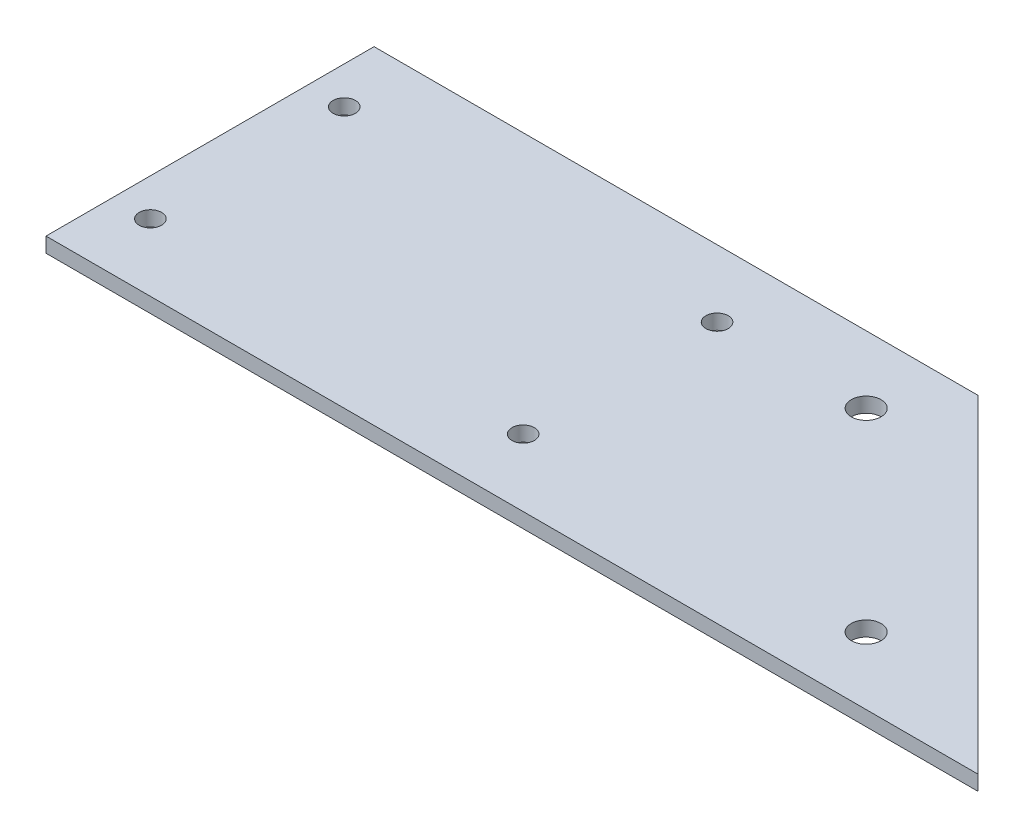
ISO-10303-21;
HEADER;
FILE_DESCRIPTION(('STEP AP214'),'2;1');
FILE_NAME('part.step','',(''),(''),'','','');
FILE_SCHEMA(('AUTOMOTIVE_DESIGN { 1 0 10303 214 1 1 1 1 }'));
ENDSEC;
DATA;
#1=APPLICATION_CONTEXT('core data for automotive mechanical design processes');
#2=APPLICATION_PROTOCOL_DEFINITION('international standard','automotive_design',2000,#1);
#3=PRODUCT_CONTEXT('',#1,'mechanical');
#4=PRODUCT('Part','Part','',(#3));
#5=PRODUCT_RELATED_PRODUCT_CATEGORY('part','',(#4));
#6=PRODUCT_DEFINITION_FORMATION('','',#4);
#7=PRODUCT_DEFINITION_CONTEXT('part definition',#1,'design');
#8=PRODUCT_DEFINITION('design','',#6,#7);
#9=PRODUCT_DEFINITION_SHAPE('','',#8);
#10=(LENGTH_UNIT() NAMED_UNIT(*) SI_UNIT(.MILLI.,.METRE.));
#11=(NAMED_UNIT(*) PLANE_ANGLE_UNIT() SI_UNIT($,.RADIAN.));
#12=(NAMED_UNIT(*) SI_UNIT($,.STERADIAN.) SOLID_ANGLE_UNIT());
#13=UNCERTAINTY_MEASURE_WITH_UNIT(LENGTH_MEASURE(1.E-05),#10,'distance_accuracy_value','');
#14=(GEOMETRIC_REPRESENTATION_CONTEXT(3) GLOBAL_UNCERTAINTY_ASSIGNED_CONTEXT((#13)) GLOBAL_UNIT_ASSIGNED_CONTEXT((#10,
#11,#12)) REPRESENTATION_CONTEXT('',''));
#15=CARTESIAN_POINT('',(0.,0.,0.));
#16=DIRECTION('',(0.,0.,1.));
#17=DIRECTION('',(1.,0.,0.));
#18=AXIS2_PLACEMENT_3D('',#15,#16,#17);
#19=CARTESIAN_POINT('',(0.,2.,-44.));
#20=DIRECTION('',(0.,-1.,0.));
#21=DIRECTION('',(0.,0.,-1.));
#22=AXIS2_PLACEMENT_3D('',#19,#20,#21);
#23=PLANE('',#22);
#24=CARTESIAN_POINT('',(75.,2.,-35.));
#25=DIRECTION('',(0.,1.,0.));
#26=DIRECTION('',(0.,0.,1.));
#27=AXIS2_PLACEMENT_3D('',#24,#25,#26);
#28=CIRCLE('',#27,1.99999999999998);
#29=CARTESIAN_POINT('',(75.,2.,-33.));
#30=VERTEX_POINT('',#29);
#31=EDGE_CURVE('E130',#30,#30,#28,.T.);
#32=ORIENTED_EDGE('',*,*,#31,.F.);
#33=EDGE_LOOP('',(#32));
#34=FACE_BOUND('',#33,.T.);
#35=CARTESIAN_POINT('',(55.,2.,-9.));
#36=DIRECTION('',(0.,1.,0.));
#37=DIRECTION('',(0.,0.,1.));
#38=AXIS2_PLACEMENT_3D('',#35,#36,#37);
#39=CIRCLE('',#38,1.5);
#40=CARTESIAN_POINT('',(55.,2.,-7.49999999999999));
#41=VERTEX_POINT('',#40);
#42=EDGE_CURVE('E118',#41,#41,#39,.T.);
#43=ORIENTED_EDGE('',*,*,#42,.F.);
#44=EDGE_LOOP('',(#43));
#45=FACE_BOUND('',#44,.T.);
#46=CARTESIAN_POINT('',(5.,2.,-35.));
#47=DIRECTION('',(0.,1.,0.));
#48=DIRECTION('',(0.,0.,1.));
#49=AXIS2_PLACEMENT_3D('',#46,#47,#48);
#50=CIRCLE('',#49,1.5);
#51=CARTESIAN_POINT('',(5.,2.,-33.5));
#52=VERTEX_POINT('',#51);
#53=EDGE_CURVE('E97',#52,#52,#50,.T.);
#54=ORIENTED_EDGE('',*,*,#53,.F.);
#55=EDGE_LOOP('',(#54));
#56=FACE_BOUND('',#55,.T.);
#57=DIRECTION('',(0.,0.,1.));
#58=VECTOR('',#57,1.);
#59=CARTESIAN_POINT('',(0.,2.,0.));
#60=LINE('',#59,#58);
#61=CARTESIAN_POINT('',(0.,2.,-44.));
#62=VERTEX_POINT('',#61);
#63=CARTESIAN_POINT('',(0.,2.,0.));
#64=VERTEX_POINT('',#63);
#65=EDGE_CURVE('E82',#62,#64,#60,.T.);
#66=ORIENTED_EDGE('',*,*,#65,.T.);
#67=DIRECTION('',(1.,0.,0.));
#68=VECTOR('',#67,1.);
#69=CARTESIAN_POINT('',(0.,2.,0.));
#70=LINE('',#69,#68);
#71=CARTESIAN_POINT('',(125.,2.,0.));
#72=VERTEX_POINT('',#71);
#73=EDGE_CURVE('E77',#64,#72,#70,.T.);
#74=ORIENTED_EDGE('',*,*,#73,.T.);
#75=DIRECTION('',(-0.707106781186546,0.,-0.707106781186549));
#76=VECTOR('',#75,1.);
#77=CARTESIAN_POINT('',(81.0000000000002,2.,-44.));
#78=LINE('',#77,#76);
#79=CARTESIAN_POINT('',(81.0000000000002,2.,-44.));
#80=VERTEX_POINT('',#79);
#81=EDGE_CURVE('E80',#72,#80,#78,.T.);
#82=ORIENTED_EDGE('',*,*,#81,.T.);
#83=DIRECTION('',(-1.,0.,0.));
#84=VECTOR('',#83,1.);
#85=CARTESIAN_POINT('',(0.,2.,-44.));
#86=LINE('',#85,#84);
#87=EDGE_CURVE('E47',#80,#62,#86,.T.);
#88=ORIENTED_EDGE('',*,*,#87,.T.);
#89=EDGE_LOOP('',(#66,#74,#82,#88));
#90=FACE_BOUND('',#89,.T.);
#91=CARTESIAN_POINT('',(5.,2.,-9.));
#92=DIRECTION('',(0.,1.,0.));
#93=DIRECTION('',(0.,0.,1.));
#94=AXIS2_PLACEMENT_3D('',#91,#92,#93);
#95=CIRCLE('',#94,1.5);
#96=CARTESIAN_POINT('',(5.,2.,-7.5));
#97=VERTEX_POINT('',#96);
#98=EDGE_CURVE('E112',#97,#97,#95,.T.);
#99=ORIENTED_EDGE('',*,*,#98,.F.);
#100=EDGE_LOOP('',(#99));
#101=FACE_BOUND('',#100,.T.);
#102=CARTESIAN_POINT('',(55.,2.,-35.));
#103=DIRECTION('',(0.,1.,0.));
#104=DIRECTION('',(0.,0.,1.));
#105=AXIS2_PLACEMENT_3D('',#102,#103,#104);
#106=CIRCLE('',#105,1.5);
#107=CARTESIAN_POINT('',(55.,2.,-33.5));
#108=VERTEX_POINT('',#107);
#109=EDGE_CURVE('E124',#108,#108,#106,.T.);
#110=ORIENTED_EDGE('',*,*,#109,.F.);
#111=EDGE_LOOP('',(#110));
#112=FACE_BOUND('',#111,.T.);
#113=CARTESIAN_POINT('',(101.,2.,-9.));
#114=DIRECTION('',(0.,1.,0.));
#115=DIRECTION('',(0.,0.,1.));
#116=AXIS2_PLACEMENT_3D('',#113,#114,#115);
#117=CIRCLE('',#116,2.);
#118=CARTESIAN_POINT('',(101.,2.,-7.));
#119=VERTEX_POINT('',#118);
#120=EDGE_CURVE('E136',#119,#119,#117,.T.);
#121=ORIENTED_EDGE('',*,*,#120,.F.);
#122=EDGE_LOOP('',(#121));
#123=FACE_BOUND('',#122,.T.);
#124=ADVANCED_FACE('F30',(#34,#45,#56,#90,#101,#112,#123),#23,.F.);
#125=CARTESIAN_POINT('',(0.,0.,-44.));
#126=DIRECTION('',(0.,-1.,0.));
#127=DIRECTION('',(0.,0.,-1.));
#128=AXIS2_PLACEMENT_3D('',#125,#126,#127);
#129=PLANE('',#128);
#130=CARTESIAN_POINT('',(75.,0.,-35.));
#131=DIRECTION('',(0.,1.,0.));
#132=DIRECTION('',(0.,0.,1.));
#133=AXIS2_PLACEMENT_3D('',#130,#131,#132);
#134=CIRCLE('',#133,1.99999999999998);
#135=CARTESIAN_POINT('',(75.,0.,-33.));
#136=VERTEX_POINT('',#135);
#137=EDGE_CURVE('E133',#136,#136,#134,.T.);
#138=ORIENTED_EDGE('',*,*,#137,.T.);
#139=EDGE_LOOP('',(#138));
#140=FACE_BOUND('',#139,.T.);
#141=CARTESIAN_POINT('',(55.,0.,-9.));
#142=DIRECTION('',(0.,1.,0.));
#143=DIRECTION('',(0.,0.,1.));
#144=AXIS2_PLACEMENT_3D('',#141,#142,#143);
#145=CIRCLE('',#144,1.5);
#146=CARTESIAN_POINT('',(55.,0.,-7.49999999999999));
#147=VERTEX_POINT('',#146);
#148=EDGE_CURVE('E121',#147,#147,#145,.T.);
#149=ORIENTED_EDGE('',*,*,#148,.T.);
#150=EDGE_LOOP('',(#149));
#151=FACE_BOUND('',#150,.T.);
#152=CARTESIAN_POINT('',(5.,0.,-35.));
#153=DIRECTION('',(0.,1.,0.));
#154=DIRECTION('',(0.,0.,1.));
#155=AXIS2_PLACEMENT_3D('',#152,#153,#154);
#156=CIRCLE('',#155,1.5);
#157=CARTESIAN_POINT('',(5.,0.,-33.5));
#158=VERTEX_POINT('',#157);
#159=EDGE_CURVE('E109',#158,#158,#156,.T.);
#160=ORIENTED_EDGE('',*,*,#159,.T.);
#161=EDGE_LOOP('',(#160));
#162=FACE_BOUND('',#161,.T.);
#163=DIRECTION('',(0.,0.,1.));
#164=VECTOR('',#163,1.);
#165=CARTESIAN_POINT('',(0.,0.,0.));
#166=LINE('',#165,#164);
#167=CARTESIAN_POINT('',(0.,0.,-44.));
#168=VERTEX_POINT('',#167);
#169=CARTESIAN_POINT('',(0.,0.,0.));
#170=VERTEX_POINT('',#169);
#171=EDGE_CURVE('E94',#168,#170,#166,.T.);
#172=ORIENTED_EDGE('',*,*,#171,.F.);
#173=DIRECTION('',(-1.,0.,0.));
#174=VECTOR('',#173,1.);
#175=CARTESIAN_POINT('',(0.,0.,-44.));
#176=LINE('',#175,#174);
#177=CARTESIAN_POINT('',(81.0000000000002,0.,-44.));
#178=VERTEX_POINT('',#177);
#179=EDGE_CURVE('E70',#178,#168,#176,.T.);
#180=ORIENTED_EDGE('',*,*,#179,.F.);
#181=DIRECTION('',(-0.707106781186546,0.,-0.707106781186549));
#182=VECTOR('',#181,1.);
#183=CARTESIAN_POINT('',(81.0000000000002,0.,-44.));
#184=LINE('',#183,#182);
#185=CARTESIAN_POINT('',(125.,0.,0.));
#186=VERTEX_POINT('',#185);
#187=EDGE_CURVE('E64',#186,#178,#184,.T.);
#188=ORIENTED_EDGE('',*,*,#187,.F.);
#189=DIRECTION('',(1.,0.,0.));
#190=VECTOR('',#189,1.);
#191=CARTESIAN_POINT('',(0.,0.,0.));
#192=LINE('',#191,#190);
#193=EDGE_CURVE('E86',#170,#186,#192,.T.);
#194=ORIENTED_EDGE('',*,*,#193,.F.);
#195=EDGE_LOOP('',(#172,#180,#188,#194));
#196=FACE_BOUND('',#195,.T.);
#197=CARTESIAN_POINT('',(5.,0.,-9.));
#198=DIRECTION('',(0.,1.,0.));
#199=DIRECTION('',(0.,0.,1.));
#200=AXIS2_PLACEMENT_3D('',#197,#198,#199);
#201=CIRCLE('',#200,1.5);
#202=CARTESIAN_POINT('',(5.,0.,-7.5));
#203=VERTEX_POINT('',#202);
#204=EDGE_CURVE('E115',#203,#203,#201,.T.);
#205=ORIENTED_EDGE('',*,*,#204,.T.);
#206=EDGE_LOOP('',(#205));
#207=FACE_BOUND('',#206,.T.);
#208=CARTESIAN_POINT('',(55.,0.,-35.));
#209=DIRECTION('',(0.,1.,0.));
#210=DIRECTION('',(0.,0.,1.));
#211=AXIS2_PLACEMENT_3D('',#208,#209,#210);
#212=CIRCLE('',#211,1.5);
#213=CARTESIAN_POINT('',(55.,0.,-33.5));
#214=VERTEX_POINT('',#213);
#215=EDGE_CURVE('E127',#214,#214,#212,.T.);
#216=ORIENTED_EDGE('',*,*,#215,.T.);
#217=EDGE_LOOP('',(#216));
#218=FACE_BOUND('',#217,.T.);
#219=CARTESIAN_POINT('',(101.,0.,-9.));
#220=DIRECTION('',(0.,1.,0.));
#221=DIRECTION('',(0.,0.,1.));
#222=AXIS2_PLACEMENT_3D('',#219,#220,#221);
#223=CIRCLE('',#222,2.);
#224=CARTESIAN_POINT('',(101.,0.,-7.));
#225=VERTEX_POINT('',#224);
#226=EDGE_CURVE('E139',#225,#225,#223,.T.);
#227=ORIENTED_EDGE('',*,*,#226,.T.);
#228=EDGE_LOOP('',(#227));
#229=FACE_BOUND('',#228,.T.);
#230=ADVANCED_FACE('F105',(#140,#151,#162,#196,#207,#218,#229),#129,.T.);
#231=CARTESIAN_POINT('',(0.,2.,0.));
#232=DIRECTION('',(1.,0.,0.));
#233=DIRECTION('',(0.,0.,-1.));
#234=AXIS2_PLACEMENT_3D('',#231,#232,#233);
#235=PLANE('',#234);
#236=ORIENTED_EDGE('',*,*,#171,.T.);
#237=DIRECTION('',(0.,-1.,0.));
#238=VECTOR('',#237,1.);
#239=CARTESIAN_POINT('',(0.,2.,0.));
#240=LINE('',#239,#238);
#241=EDGE_CURVE('E11',#64,#170,#240,.T.);
#242=ORIENTED_EDGE('',*,*,#241,.F.);
#243=ORIENTED_EDGE('',*,*,#65,.F.);
#244=DIRECTION('',(0.,-1.,0.));
#245=VECTOR('',#244,1.);
#246=CARTESIAN_POINT('',(0.,2.,-44.));
#247=LINE('',#246,#245);
#248=EDGE_CURVE('E90',#62,#168,#247,.T.);
#249=ORIENTED_EDGE('',*,*,#248,.T.);
#250=EDGE_LOOP('',(#236,#242,#243,#249));
#251=FACE_BOUND('',#250,.T.);
#252=ADVANCED_FACE('F32',(#251),#235,.F.);
#253=CARTESIAN_POINT('',(0.,2.,0.));
#254=DIRECTION('',(0.,0.,-1.));
#255=DIRECTION('',(-1.,0.,0.));
#256=AXIS2_PLACEMENT_3D('',#253,#254,#255);
#257=PLANE('',#256);
#258=ORIENTED_EDGE('',*,*,#193,.T.);
#259=DIRECTION('',(0.,-1.,0.));
#260=VECTOR('',#259,1.);
#261=CARTESIAN_POINT('',(125.,2.,0.));
#262=LINE('',#261,#260);
#263=EDGE_CURVE('E39',#72,#186,#262,.T.);
#264=ORIENTED_EDGE('',*,*,#263,.F.);
#265=ORIENTED_EDGE('',*,*,#73,.F.);
#266=ORIENTED_EDGE('',*,*,#241,.T.);
#267=EDGE_LOOP('',(#258,#264,#265,#266));
#268=FACE_BOUND('',#267,.T.);
#269=ADVANCED_FACE('F85',(#268),#257,.F.);
#270=CARTESIAN_POINT('',(81.0000000000002,2.,-44.));
#271=DIRECTION('',(-0.707106781186549,0.,0.707106781186546));
#272=DIRECTION('',(0.707106781186546,0.,0.707106781186549));
#273=AXIS2_PLACEMENT_3D('',#270,#271,#272);
#274=PLANE('',#273);
#275=ORIENTED_EDGE('',*,*,#187,.T.);
#276=DIRECTION('',(0.,-1.,0.));
#277=VECTOR('',#276,1.);
#278=CARTESIAN_POINT('',(81.0000000000002,2.,-44.));
#279=LINE('',#278,#277);
#280=EDGE_CURVE('E87',#80,#178,#279,.T.);
#281=ORIENTED_EDGE('',*,*,#280,.F.);
#282=ORIENTED_EDGE('',*,*,#81,.F.);
#283=ORIENTED_EDGE('',*,*,#263,.T.);
#284=EDGE_LOOP('',(#275,#281,#282,#283));
#285=FACE_BOUND('',#284,.T.);
#286=ADVANCED_FACE('F88',(#285),#274,.F.);
#287=CARTESIAN_POINT('',(0.,2.,-44.));
#288=DIRECTION('',(0.,0.,1.));
#289=DIRECTION('',(1.,0.,0.));
#290=AXIS2_PLACEMENT_3D('',#287,#288,#289);
#291=PLANE('',#290);
#292=ORIENTED_EDGE('',*,*,#179,.T.);
#293=ORIENTED_EDGE('',*,*,#248,.F.);
#294=ORIENTED_EDGE('',*,*,#87,.F.);
#295=ORIENTED_EDGE('',*,*,#280,.T.);
#296=EDGE_LOOP('',(#292,#293,#294,#295));
#297=FACE_BOUND('',#296,.T.);
#298=ADVANCED_FACE('F102',(#297),#291,.F.);
#299=CARTESIAN_POINT('',(5.,2.,-35.));
#300=DIRECTION('',(0.,-1.,0.));
#301=DIRECTION('',(0.,0.,-1.));
#302=AXIS2_PLACEMENT_3D('',#299,#300,#301);
#303=CYLINDRICAL_SURFACE('',#302,1.5);
#304=ORIENTED_EDGE('',*,*,#53,.T.);
#305=EDGE_LOOP('',(#304));
#306=FACE_BOUND('',#305,.T.);
#307=ORIENTED_EDGE('',*,*,#159,.F.);
#308=EDGE_LOOP('',(#307));
#309=FACE_BOUND('',#308,.T.);
#310=ADVANCED_FACE('F159',(#306,#309),#303,.F.);
#311=CARTESIAN_POINT('',(5.,2.,-9.));
#312=DIRECTION('',(0.,-1.,0.));
#313=DIRECTION('',(0.,0.,-1.));
#314=AXIS2_PLACEMENT_3D('',#311,#312,#313);
#315=CYLINDRICAL_SURFACE('',#314,1.5);
#316=ORIENTED_EDGE('',*,*,#98,.T.);
#317=EDGE_LOOP('',(#316));
#318=FACE_BOUND('',#317,.T.);
#319=ORIENTED_EDGE('',*,*,#204,.F.);
#320=EDGE_LOOP('',(#319));
#321=FACE_BOUND('',#320,.T.);
#322=ADVANCED_FACE('F205',(#318,#321),#315,.F.);
#323=CARTESIAN_POINT('',(55.,2.,-9.));
#324=DIRECTION('',(0.,-1.,0.));
#325=DIRECTION('',(0.,0.,-1.));
#326=AXIS2_PLACEMENT_3D('',#323,#324,#325);
#327=CYLINDRICAL_SURFACE('',#326,1.5);
#328=ORIENTED_EDGE('',*,*,#42,.T.);
#329=EDGE_LOOP('',(#328));
#330=FACE_BOUND('',#329,.T.);
#331=ORIENTED_EDGE('',*,*,#148,.F.);
#332=EDGE_LOOP('',(#331));
#333=FACE_BOUND('',#332,.T.);
#334=ADVANCED_FACE('F213',(#330,#333),#327,.F.);
#335=CARTESIAN_POINT('',(55.,2.,-35.));
#336=DIRECTION('',(0.,-1.,0.));
#337=DIRECTION('',(0.,0.,-1.));
#338=AXIS2_PLACEMENT_3D('',#335,#336,#337);
#339=CYLINDRICAL_SURFACE('',#338,1.5);
#340=ORIENTED_EDGE('',*,*,#109,.T.);
#341=EDGE_LOOP('',(#340));
#342=FACE_BOUND('',#341,.T.);
#343=ORIENTED_EDGE('',*,*,#215,.F.);
#344=EDGE_LOOP('',(#343));
#345=FACE_BOUND('',#344,.T.);
#346=ADVANCED_FACE('F221',(#342,#345),#339,.F.);
#347=CARTESIAN_POINT('',(75.,2.,-35.));
#348=DIRECTION('',(0.,-1.,0.));
#349=DIRECTION('',(0.,0.,-1.));
#350=AXIS2_PLACEMENT_3D('',#347,#348,#349);
#351=CYLINDRICAL_SURFACE('',#350,1.99999999999998);
#352=ORIENTED_EDGE('',*,*,#31,.T.);
#353=EDGE_LOOP('',(#352));
#354=FACE_BOUND('',#353,.T.);
#355=ORIENTED_EDGE('',*,*,#137,.F.);
#356=EDGE_LOOP('',(#355));
#357=FACE_BOUND('',#356,.T.);
#358=ADVANCED_FACE('F230',(#354,#357),#351,.F.);
#359=CARTESIAN_POINT('',(101.,2.,-9.));
#360=DIRECTION('',(0.,-1.,0.));
#361=DIRECTION('',(0.,0.,-1.));
#362=AXIS2_PLACEMENT_3D('',#359,#360,#361);
#363=CYLINDRICAL_SURFACE('',#362,2.);
#364=ORIENTED_EDGE('',*,*,#120,.T.);
#365=EDGE_LOOP('',(#364));
#366=FACE_BOUND('',#365,.T.);
#367=ORIENTED_EDGE('',*,*,#226,.F.);
#368=EDGE_LOOP('',(#367));
#369=FACE_BOUND('',#368,.T.);
#370=ADVANCED_FACE('F145',(#366,#369),#363,.F.);
#371=CLOSED_SHELL('',(#124,#230,#252,#269,#286,#298,#310,#322,#334,#346,#358,#370));
#372=MANIFOLD_SOLID_BREP('B2',#371);
#373=ADVANCED_BREP_SHAPE_REPRESENTATION('',(#18,#372),#14);
#374=SHAPE_DEFINITION_REPRESENTATION(#9,#373);
ENDSEC;
END-ISO-10303-21;
